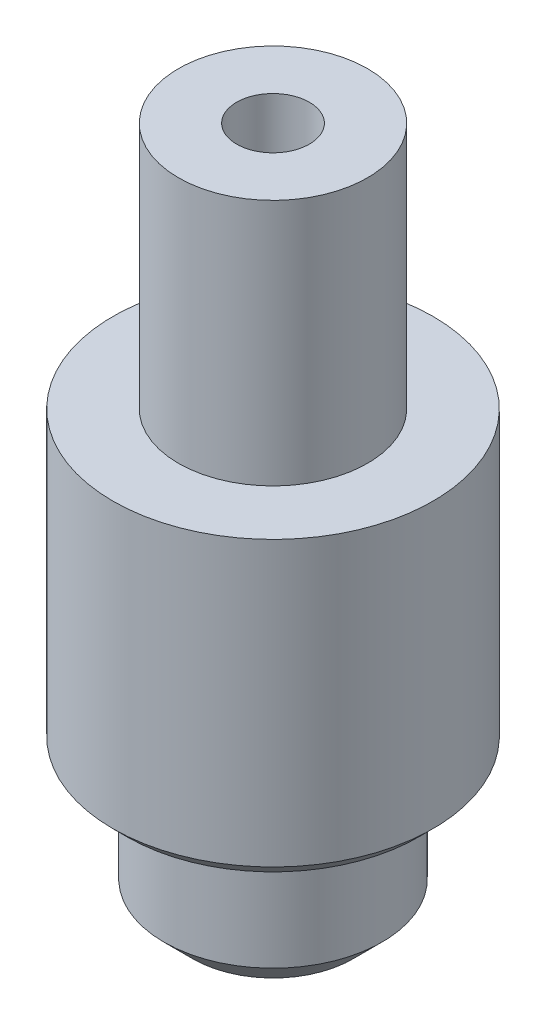
ISO-10303-21;
HEADER;
FILE_DESCRIPTION(('STEP AP214'),'2;1');
FILE_NAME('part.step','',(''),(''),'','','');
FILE_SCHEMA(('AUTOMOTIVE_DESIGN { 1 0 10303 214 1 1 1 1 }'));
ENDSEC;
DATA;
#1=APPLICATION_CONTEXT('core data for automotive mechanical design processes');
#2=APPLICATION_PROTOCOL_DEFINITION('international standard','automotive_design',2000,#1);
#3=PRODUCT_CONTEXT('',#1,'mechanical');
#4=PRODUCT('Part','Part','',(#3));
#5=PRODUCT_RELATED_PRODUCT_CATEGORY('part','',(#4));
#6=PRODUCT_DEFINITION_FORMATION('','',#4);
#7=PRODUCT_DEFINITION_CONTEXT('part definition',#1,'design');
#8=PRODUCT_DEFINITION('design','',#6,#7);
#9=PRODUCT_DEFINITION_SHAPE('','',#8);
#10=(LENGTH_UNIT() NAMED_UNIT(*) SI_UNIT(.MILLI.,.METRE.));
#11=(NAMED_UNIT(*) PLANE_ANGLE_UNIT() SI_UNIT($,.RADIAN.));
#12=(NAMED_UNIT(*) SI_UNIT($,.STERADIAN.) SOLID_ANGLE_UNIT());
#13=UNCERTAINTY_MEASURE_WITH_UNIT(LENGTH_MEASURE(1.E-05),#10,'distance_accuracy_value','');
#14=(GEOMETRIC_REPRESENTATION_CONTEXT(3) GLOBAL_UNCERTAINTY_ASSIGNED_CONTEXT((#13)) GLOBAL_UNIT_ASSIGNED_CONTEXT((#10,
#11,#12)) REPRESENTATION_CONTEXT('',''));
#15=CARTESIAN_POINT('',(0.,0.,0.));
#16=DIRECTION('',(0.,0.,1.));
#17=DIRECTION('',(1.,0.,0.));
#18=AXIS2_PLACEMENT_3D('',#15,#16,#17);
#19=CARTESIAN_POINT('',(-11.0000000000001,-20.4999999999997,0.));
#20=DIRECTION('',(0.,1.,0.));
#21=DIRECTION('',(0.,0.,1.));
#22=AXIS2_PLACEMENT_3D('',#19,#20,#21);
#23=PLANE('',#22);
#24=CARTESIAN_POINT('',(0.,-20.4999999999997,0.));
#25=DIRECTION('',(0.,1.,0.));
#26=DIRECTION('',(0.,0.,1.));
#27=AXIS2_PLACEMENT_3D('',#24,#25,#26);
#28=CIRCLE('',#27,10.0000000000001);
#29=CARTESIAN_POINT('',(0.,-20.4999999999997,10.0000000000001));
#30=VERTEX_POINT('',#29);
#31=EDGE_CURVE('E37',#30,#30,#28,.F.);
#32=ORIENTED_EDGE('',*,*,#31,.T.);
#33=EDGE_LOOP('',(#32));
#34=FACE_BOUND('',#33,.T.);
#35=CARTESIAN_POINT('',(0.,-20.4999999999997,0.));
#36=DIRECTION('',(0.,-1.,0.));
#37=DIRECTION('',(0.,0.,-1.));
#38=AXIS2_PLACEMENT_3D('',#35,#36,#37);
#39=CIRCLE('',#38,7.50000000000028);
#40=CARTESIAN_POINT('',(0.,-20.4999999999997,-7.50000000000028));
#41=VERTEX_POINT('',#40);
#42=EDGE_CURVE('E71',#41,#41,#39,.T.);
#43=ORIENTED_EDGE('',*,*,#42,.F.);
#44=EDGE_LOOP('',(#43));
#45=FACE_BOUND('',#44,.T.);
#46=ADVANCED_FACE('F30',(#34,#45),#23,.F.);
#47=CARTESIAN_POINT('',(0.,-29.9999999999998,0.));
#48=DIRECTION('',(0.,-1.,0.));
#49=DIRECTION('',(0.,0.,-1.));
#50=AXIS2_PLACEMENT_3D('',#47,#48,#49);
#51=CYLINDRICAL_SURFACE('',#50,11.0000000000001);
#52=CARTESIAN_POINT('',(0.,-19.4999999999998,0.));
#53=DIRECTION('',(0.,1.,0.));
#54=DIRECTION('',(0.,0.,1.));
#55=AXIS2_PLACEMENT_3D('',#52,#53,#54);
#56=CIRCLE('',#55,11.0000000000001);
#57=CARTESIAN_POINT('',(0.,-19.4999999999998,11.0000000000001));
#58=VERTEX_POINT('',#57);
#59=EDGE_CURVE('E10',#58,#58,#56,.T.);
#60=ORIENTED_EDGE('',*,*,#59,.T.);
#61=EDGE_LOOP('',(#60));
#62=FACE_BOUND('',#61,.T.);
#63=CARTESIAN_POINT('',(0.,0.,0.));
#64=DIRECTION('',(0.,-1.,0.));
#65=DIRECTION('',(0.,0.,-1.));
#66=AXIS2_PLACEMENT_3D('',#63,#64,#65);
#67=CIRCLE('',#66,11.0000000000001);
#68=CARTESIAN_POINT('',(0.,0.,-11.0000000000001));
#69=VERTEX_POINT('',#68);
#70=EDGE_CURVE('E50',#69,#69,#67,.T.);
#71=ORIENTED_EDGE('',*,*,#70,.T.);
#72=EDGE_LOOP('',(#71));
#73=FACE_BOUND('',#72,.T.);
#74=ADVANCED_FACE('F78',(#62,#73),#51,.T.);
#75=CARTESIAN_POINT('',(-11.0000000000001,0.,0.));
#76=DIRECTION('',(0.,-1.,0.));
#77=DIRECTION('',(0.,0.,-1.));
#78=AXIS2_PLACEMENT_3D('',#75,#76,#77);
#79=PLANE('',#78);
#80=ORIENTED_EDGE('',*,*,#70,.F.);
#81=EDGE_LOOP('',(#80));
#82=FACE_BOUND('',#81,.T.);
#83=CARTESIAN_POINT('',(0.,0.,0.));
#84=DIRECTION('',(0.,-1.,0.));
#85=DIRECTION('',(0.,0.,-1.));
#86=AXIS2_PLACEMENT_3D('',#83,#84,#85);
#87=CIRCLE('',#86,6.49999999999906);
#88=CARTESIAN_POINT('',(0.,0.,-6.49999999999906));
#89=VERTEX_POINT('',#88);
#90=EDGE_CURVE('E53',#89,#89,#87,.T.);
#91=ORIENTED_EDGE('',*,*,#90,.T.);
#92=EDGE_LOOP('',(#91));
#93=FACE_BOUND('',#92,.T.);
#94=ADVANCED_FACE('F83',(#82,#93),#79,.F.);
#95=CARTESIAN_POINT('',(0.,-29.9999999999998,0.));
#96=DIRECTION('',(0.,-1.,0.));
#97=DIRECTION('',(0.,0.,-1.));
#98=AXIS2_PLACEMENT_3D('',#95,#96,#97);
#99=CYLINDRICAL_SURFACE('',#98,6.49999999999906);
#100=ORIENTED_EDGE('',*,*,#90,.F.);
#101=EDGE_LOOP('',(#100));
#102=FACE_BOUND('',#101,.T.);
#103=CARTESIAN_POINT('',(0.,17.0000000000003,0.));
#104=DIRECTION('',(0.,-1.,0.));
#105=DIRECTION('',(0.,0.,-1.));
#106=AXIS2_PLACEMENT_3D('',#103,#104,#105);
#107=CIRCLE('',#106,6.49999999999906);
#108=CARTESIAN_POINT('',(0.,17.0000000000003,-6.49999999999906));
#109=VERTEX_POINT('',#108);
#110=EDGE_CURVE('E56',#109,#109,#107,.T.);
#111=ORIENTED_EDGE('',*,*,#110,.T.);
#112=EDGE_LOOP('',(#111));
#113=FACE_BOUND('',#112,.T.);
#114=ADVANCED_FACE('F125',(#102,#113),#99,.T.);
#115=CARTESIAN_POINT('',(-6.49999999999906,17.0000000000003,0.));
#116=DIRECTION('',(0.,-1.,0.));
#117=DIRECTION('',(0.,0.,-1.));
#118=AXIS2_PLACEMENT_3D('',#115,#116,#117);
#119=PLANE('',#118);
#120=ORIENTED_EDGE('',*,*,#110,.F.);
#121=EDGE_LOOP('',(#120));
#122=FACE_BOUND('',#121,.T.);
#123=CARTESIAN_POINT('',(0.,17.0000000000003,0.));
#124=DIRECTION('',(0.,-1.,0.));
#125=DIRECTION('',(0.,0.,-1.));
#126=AXIS2_PLACEMENT_3D('',#123,#124,#125);
#127=CIRCLE('',#126,2.50000000000001);
#128=CARTESIAN_POINT('',(0.,17.0000000000003,-2.50000000000001));
#129=VERTEX_POINT('',#128);
#130=EDGE_CURVE('E59',#129,#129,#127,.T.);
#131=ORIENTED_EDGE('',*,*,#130,.T.);
#132=EDGE_LOOP('',(#131));
#133=FACE_BOUND('',#132,.T.);
#134=ADVANCED_FACE('F121',(#122,#133),#119,.F.);
#135=CARTESIAN_POINT('',(0.,-29.9999999999998,0.));
#136=DIRECTION('',(0.,-1.,0.));
#137=DIRECTION('',(0.,0.,-1.));
#138=AXIS2_PLACEMENT_3D('',#135,#136,#137);
#139=CYLINDRICAL_SURFACE('',#138,2.50000000000001);
#140=ORIENTED_EDGE('',*,*,#130,.F.);
#141=EDGE_LOOP('',(#140));
#142=FACE_BOUND('',#141,.T.);
#143=CARTESIAN_POINT('',(0.,-20.4999999999997,0.));
#144=DIRECTION('',(0.,-1.,0.));
#145=DIRECTION('',(0.,0.,-1.));
#146=AXIS2_PLACEMENT_3D('',#143,#144,#145);
#147=CIRCLE('',#146,2.5);
#148=CARTESIAN_POINT('',(0.,-20.4999999999997,-2.5));
#149=VERTEX_POINT('',#148);
#150=EDGE_CURVE('E62',#149,#149,#147,.T.);
#151=ORIENTED_EDGE('',*,*,#150,.T.);
#152=EDGE_LOOP('',(#151));
#153=FACE_BOUND('',#152,.T.);
#154=ADVANCED_FACE('F114',(#142,#153),#139,.F.);
#155=CARTESIAN_POINT('',(-2.5,-20.4999999999997,0.));
#156=DIRECTION('',(0.,-1.,0.));
#157=DIRECTION('',(0.,0.,-1.));
#158=AXIS2_PLACEMENT_3D('',#155,#156,#157);
#159=PLANE('',#158);
#160=ORIENTED_EDGE('',*,*,#150,.F.);
#161=EDGE_LOOP('',(#160));
#162=FACE_BOUND('',#161,.T.);
#163=CARTESIAN_POINT('',(0.,-20.4999999999997,0.));
#164=DIRECTION('',(0.,-1.,0.));
#165=DIRECTION('',(0.,0.,-1.));
#166=AXIS2_PLACEMENT_3D('',#163,#164,#165);
#167=CIRCLE('',#166,2.);
#168=CARTESIAN_POINT('',(0.,-20.4999999999997,-2.));
#169=VERTEX_POINT('',#168);
#170=EDGE_CURVE('E65',#169,#169,#167,.T.);
#171=ORIENTED_EDGE('',*,*,#170,.T.);
#172=EDGE_LOOP('',(#171));
#173=FACE_BOUND('',#172,.T.);
#174=ADVANCED_FACE('F108',(#162,#173),#159,.F.);
#175=CARTESIAN_POINT('',(0.,-29.9999999999998,0.));
#176=DIRECTION('',(0.,-1.,0.));
#177=DIRECTION('',(0.,0.,-1.));
#178=AXIS2_PLACEMENT_3D('',#175,#176,#177);
#179=CYLINDRICAL_SURFACE('',#178,2.);
#180=ORIENTED_EDGE('',*,*,#170,.F.);
#181=EDGE_LOOP('',(#180));
#182=FACE_BOUND('',#181,.T.);
#183=CARTESIAN_POINT('',(0.,-29.9999999999998,0.));
#184=DIRECTION('',(0.,-1.,0.));
#185=DIRECTION('',(0.,0.,-1.));
#186=AXIS2_PLACEMENT_3D('',#183,#184,#185);
#187=CIRCLE('',#186,2.);
#188=CARTESIAN_POINT('',(0.,-29.9999999999998,-2.));
#189=VERTEX_POINT('',#188);
#190=EDGE_CURVE('E68',#189,#189,#187,.T.);
#191=ORIENTED_EDGE('',*,*,#190,.T.);
#192=EDGE_LOOP('',(#191));
#193=FACE_BOUND('',#192,.T.);
#194=ADVANCED_FACE('F103',(#182,#193),#179,.F.);
#195=CARTESIAN_POINT('',(-7.50000000000028,-29.9999999999998,0.));
#196=DIRECTION('',(0.,1.,0.));
#197=DIRECTION('',(0.,0.,1.));
#198=AXIS2_PLACEMENT_3D('',#195,#196,#197);
#199=PLANE('',#198);
#200=CARTESIAN_POINT('',(0.,-29.9999999999998,0.));
#201=DIRECTION('',(0.,1.,0.));
#202=DIRECTION('',(0.,0.,1.));
#203=AXIS2_PLACEMENT_3D('',#200,#201,#202);
#204=CIRCLE('',#203,5.5000000000003);
#205=CARTESIAN_POINT('',(0.,-29.9999999999998,5.5000000000003));
#206=VERTEX_POINT('',#205);
#207=EDGE_CURVE('E45',#206,#206,#204,.F.);
#208=ORIENTED_EDGE('',*,*,#207,.T.);
#209=EDGE_LOOP('',(#208));
#210=FACE_BOUND('',#209,.T.);
#211=ORIENTED_EDGE('',*,*,#190,.F.);
#212=EDGE_LOOP('',(#211));
#213=FACE_BOUND('',#212,.T.);
#214=ADVANCED_FACE('F94',(#210,#213),#199,.F.);
#215=CARTESIAN_POINT('',(0.,-29.9999999999998,0.));
#216=DIRECTION('',(0.,-1.,0.));
#217=DIRECTION('',(0.,0.,-1.));
#218=AXIS2_PLACEMENT_3D('',#215,#216,#217);
#219=CYLINDRICAL_SURFACE('',#218,7.50000000000028);
#220=CARTESIAN_POINT('',(0.,-27.9999999999998,0.));
#221=DIRECTION('',(0.,1.,0.));
#222=DIRECTION('',(0.,0.,1.));
#223=AXIS2_PLACEMENT_3D('',#220,#221,#222);
#224=CIRCLE('',#223,7.50000000000028);
#225=CARTESIAN_POINT('',(0.,-27.9999999999998,7.50000000000028));
#226=VERTEX_POINT('',#225);
#227=EDGE_CURVE('E41',#226,#226,#224,.T.);
#228=ORIENTED_EDGE('',*,*,#227,.T.);
#229=EDGE_LOOP('',(#228));
#230=FACE_BOUND('',#229,.T.);
#231=ORIENTED_EDGE('',*,*,#42,.T.);
#232=EDGE_LOOP('',(#231));
#233=FACE_BOUND('',#232,.T.);
#234=ADVANCED_FACE('F75',(#230,#233),#219,.T.);
#235=CARTESIAN_POINT('',(0.,-29.9999999999998,0.));
#236=DIRECTION('',(0.,1.,0.));
#237=DIRECTION('',(0.,0.,1.));
#238=AXIS2_PLACEMENT_3D('',#235,#236,#237);
#239=CONICAL_SURFACE('',#238,5.5000000000003,0.785398163397447);
#240=ORIENTED_EDGE('',*,*,#227,.F.);
#241=EDGE_LOOP('',(#240));
#242=FACE_BOUND('',#241,.T.);
#243=ORIENTED_EDGE('',*,*,#207,.F.);
#244=EDGE_LOOP('',(#243));
#245=FACE_BOUND('',#244,.T.);
#246=ADVANCED_FACE('F86',(#242,#245),#239,.T.);
#247=CARTESIAN_POINT('',(0.,-20.4999999999997,0.));
#248=DIRECTION('',(0.,1.,0.));
#249=DIRECTION('',(0.,0.,1.));
#250=AXIS2_PLACEMENT_3D('',#247,#248,#249);
#251=CONICAL_SURFACE('',#250,10.0000000000001,0.78539816339745);
#252=ORIENTED_EDGE('',*,*,#59,.F.);
#253=EDGE_LOOP('',(#252));
#254=FACE_BOUND('',#253,.T.);
#255=ORIENTED_EDGE('',*,*,#31,.F.);
#256=EDGE_LOOP('',(#255));
#257=FACE_BOUND('',#256,.T.);
#258=ADVANCED_FACE('F32',(#254,#257),#251,.T.);
#259=CLOSED_SHELL('',(#46,#74,#94,#114,#134,#154,#174,#194,#214,#234,#246,#258));
#260=MANIFOLD_SOLID_BREP('B2',#259);
#261=ADVANCED_BREP_SHAPE_REPRESENTATION('',(#18,#260),#14);
#262=SHAPE_DEFINITION_REPRESENTATION(#9,#261);
ENDSEC;
END-ISO-10303-21;
